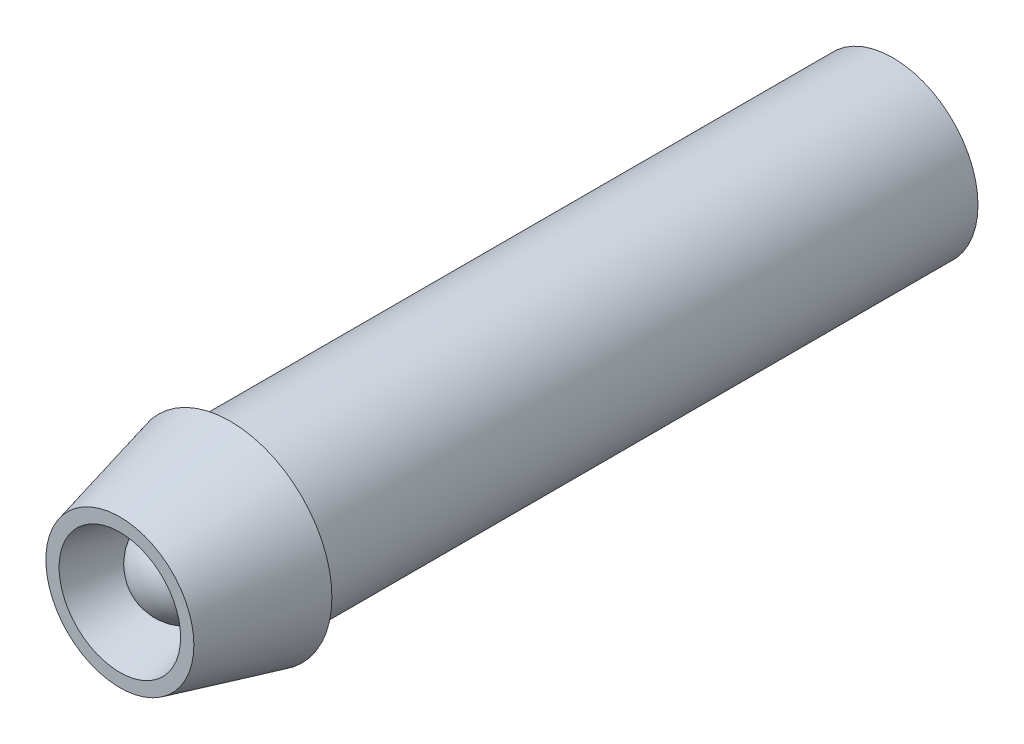
ISO-10303-21;
HEADER;
FILE_DESCRIPTION(('STEP AP214'),'2;1');
FILE_NAME('part.step','',(''),(''),'','','');
FILE_SCHEMA(('AUTOMOTIVE_DESIGN { 1 0 10303 214 1 1 1 1 }'));
ENDSEC;
DATA;
#1=APPLICATION_CONTEXT('core data for automotive mechanical design processes');
#2=APPLICATION_PROTOCOL_DEFINITION('international standard','automotive_design',2000,#1);
#3=PRODUCT_CONTEXT('',#1,'mechanical');
#4=PRODUCT('Part','Part','',(#3));
#5=PRODUCT_RELATED_PRODUCT_CATEGORY('part','',(#4));
#6=PRODUCT_DEFINITION_FORMATION('','',#4);
#7=PRODUCT_DEFINITION_CONTEXT('part definition',#1,'design');
#8=PRODUCT_DEFINITION('design','',#6,#7);
#9=PRODUCT_DEFINITION_SHAPE('','',#8);
#10=(LENGTH_UNIT() NAMED_UNIT(*) SI_UNIT(.MILLI.,.METRE.));
#11=(NAMED_UNIT(*) PLANE_ANGLE_UNIT() SI_UNIT($,.RADIAN.));
#12=(NAMED_UNIT(*) SI_UNIT($,.STERADIAN.) SOLID_ANGLE_UNIT());
#13=UNCERTAINTY_MEASURE_WITH_UNIT(LENGTH_MEASURE(1.E-05),#10,'distance_accuracy_value','');
#14=(GEOMETRIC_REPRESENTATION_CONTEXT(3) GLOBAL_UNCERTAINTY_ASSIGNED_CONTEXT((#13)) GLOBAL_UNIT_ASSIGNED_CONTEXT((#10,
#11,#12)) REPRESENTATION_CONTEXT('',''));
#15=CARTESIAN_POINT('',(0.,0.,0.));
#16=DIRECTION('',(0.,0.,1.));
#17=DIRECTION('',(1.,0.,0.));
#18=AXIS2_PLACEMENT_3D('',#15,#16,#17);
#19=CARTESIAN_POINT('',(0.,0.,1.99999999999994));
#20=DIRECTION('',(0.,0.,1.));
#21=DIRECTION('',(1.,0.,0.));
#22=AXIS2_PLACEMENT_3D('',#19,#20,#21);
#23=PLANE('',#22);
#24=CARTESIAN_POINT('',(0.,0.,1.99999999999994));
#25=DIRECTION('',(0.,0.,1.));
#26=DIRECTION('',(1.,0.,0.));
#27=AXIS2_PLACEMENT_3D('',#24,#25,#26);
#28=CIRCLE('',#27,2.);
#29=CARTESIAN_POINT('',(2.,0.,1.99999999999994));
#30=VERTEX_POINT('',#29);
#31=EDGE_CURVE('E11',#30,#30,#28,.T.);
#32=ORIENTED_EDGE('',*,*,#31,.F.);
#33=EDGE_LOOP('',(#32));
#34=FACE_BOUND('',#33,.T.);
#35=ADVANCED_FACE('F43',(#34),#23,.F.);
#36=CARTESIAN_POINT('',(0.,0.,1.99999999999994));
#37=DIRECTION('',(0.,0.,1.));
#38=DIRECTION('',(1.,0.,0.));
#39=AXIS2_PLACEMENT_3D('',#36,#37,#38);
#40=SPHERICAL_SURFACE('',#39,2.);
#41=ORIENTED_EDGE('',*,*,#31,.T.);
#42=EDGE_LOOP('',(#41));
#43=FACE_BOUND('',#42,.T.);
#44=ADVANCED_FACE('F45',(#43),#40,.T.);
#45=CLOSED_SHELL('',(#35,#44));
#46=MANIFOLD_SOLID_BREP('B2',#45);
#47=CARTESIAN_POINT('',(0.,0.,5.));
#48=DIRECTION('',(0.,0.,1.));
#49=DIRECTION('',(1.,0.,0.));
#50=AXIS2_PLACEMENT_3D('',#47,#48,#49);
#51=PLANE('',#50);
#52=CARTESIAN_POINT('',(0.,0.,5.));
#53=DIRECTION('',(0.,0.,1.));
#54=DIRECTION('',(1.,0.,0.));
#55=AXIS2_PLACEMENT_3D('',#52,#53,#54);
#56=CIRCLE('',#55,2.75);
#57=CARTESIAN_POINT('',(2.75,0.,5.));
#58=VERTEX_POINT('',#57);
#59=EDGE_CURVE('E78',#58,#58,#56,.F.);
#60=ORIENTED_EDGE('',*,*,#59,.T.);
#61=EDGE_LOOP('',(#60));
#62=FACE_BOUND('',#61,.T.);
#63=CARTESIAN_POINT('',(0.,0.,5.));
#64=DIRECTION('',(0.,0.,1.));
#65=DIRECTION('',(1.,0.,0.));
#66=AXIS2_PLACEMENT_3D('',#63,#64,#65);
#67=CIRCLE('',#66,3.35);
#68=CARTESIAN_POINT('',(3.35,0.,5.));
#69=VERTEX_POINT('',#68);
#70=EDGE_CURVE('E91',#69,#69,#67,.T.);
#71=ORIENTED_EDGE('',*,*,#70,.T.);
#72=EDGE_LOOP('',(#71));
#73=FACE_BOUND('',#72,.T.);
#74=ADVANCED_FACE('F71',(#62,#73),#51,.T.);
#75=CARTESIAN_POINT('',(0.,0.,0.));
#76=DIRECTION('',(0.,0.,1.));
#77=DIRECTION('',(1.,0.,0.));
#78=AXIS2_PLACEMENT_3D('',#75,#76,#77);
#79=PLANE('',#78);
#80=CARTESIAN_POINT('',(0.,0.,0.));
#81=DIRECTION('',(0.,0.,1.));
#82=DIRECTION('',(1.,0.,0.));
#83=AXIS2_PLACEMENT_3D('',#80,#81,#82);
#84=CIRCLE('',#83,3.85);
#85=CARTESIAN_POINT('',(3.85,0.,0.));
#86=VERTEX_POINT('',#85);
#87=EDGE_CURVE('E42',#86,#86,#84,.F.);
#88=ORIENTED_EDGE('',*,*,#87,.F.);
#89=EDGE_LOOP('',(#88));
#90=FACE_BOUND('',#89,.T.);
#91=CARTESIAN_POINT('',(0.,0.,0.));
#92=DIRECTION('',(0.,0.,1.));
#93=DIRECTION('',(1.,0.,0.));
#94=AXIS2_PLACEMENT_3D('',#91,#92,#93);
#95=CIRCLE('',#94,4.6);
#96=CARTESIAN_POINT('',(4.6,0.,0.));
#97=VERTEX_POINT('',#96);
#98=EDGE_CURVE('E86',#97,#97,#95,.F.);
#99=ORIENTED_EDGE('',*,*,#98,.T.);
#100=EDGE_LOOP('',(#99));
#101=FACE_BOUND('',#100,.T.);
#102=ADVANCED_FACE('F116',(#90,#101),#79,.F.);
#103=CARTESIAN_POINT('',(0.,0.,5.));
#104=DIRECTION('',(0.,0.,-1.));
#105=DIRECTION('',(-1.,0.,0.));
#106=AXIS2_PLACEMENT_3D('',#103,#104,#105);
#107=CYLINDRICAL_SURFACE('',#106,2.);
#108=CARTESIAN_POINT('',(0.,0.,1.99999999999994));
#109=DIRECTION('',(0.,0.,1.));
#110=DIRECTION('',(1.,0.,0.));
#111=AXIS2_PLACEMENT_3D('',#108,#109,#110);
#112=CIRCLE('',#111,2.);
#113=CARTESIAN_POINT('',(2.,0.,1.99999999999994));
#114=VERTEX_POINT('',#113);
#115=EDGE_CURVE('E82',#114,#114,#112,.T.);
#116=ORIENTED_EDGE('',*,*,#115,.T.);
#117=EDGE_LOOP('',(#116));
#118=FACE_BOUND('',#117,.T.);
#119=CARTESIAN_POINT('',(0.,0.,0.));
#120=DIRECTION('',(0.,0.,1.));
#121=DIRECTION('',(1.,0.,0.));
#122=AXIS2_PLACEMENT_3D('',#119,#120,#121);
#123=CIRCLE('',#122,2.);
#124=CARTESIAN_POINT('',(2.,0.,0.));
#125=VERTEX_POINT('',#124);
#126=EDGE_CURVE('E94',#125,#125,#123,.T.);
#127=ORIENTED_EDGE('',*,*,#126,.F.);
#128=EDGE_LOOP('',(#127));
#129=FACE_BOUND('',#128,.T.);
#130=ADVANCED_FACE('F121',(#118,#129),#107,.F.);
#131=CARTESIAN_POINT('',(0.,0.,5.));
#132=DIRECTION('',(0.,0.,-1.));
#133=DIRECTION('',(-1.,0.,0.));
#134=AXIS2_PLACEMENT_3D('',#131,#132,#133);
#135=CONICAL_SURFACE('',#134,3.35,0.244978663126864);
#136=ORIENTED_EDGE('',*,*,#98,.F.);
#137=EDGE_LOOP('',(#136));
#138=FACE_BOUND('',#137,.T.);
#139=ORIENTED_EDGE('',*,*,#70,.F.);
#140=EDGE_LOOP('',(#139));
#141=FACE_BOUND('',#140,.T.);
#142=ADVANCED_FACE('F125',(#138,#141),#135,.T.);
#143=CARTESIAN_POINT('',(0.,0.,1.99999999999994));
#144=DIRECTION('',(0.,0.,1.));
#145=DIRECTION('',(1.,0.,0.));
#146=AXIS2_PLACEMENT_3D('',#143,#144,#145);
#147=CONICAL_SURFACE('',#146,2.,0.244978663126861);
#148=ORIENTED_EDGE('',*,*,#59,.F.);
#149=EDGE_LOOP('',(#148));
#150=FACE_BOUND('',#149,.T.);
#151=ORIENTED_EDGE('',*,*,#115,.F.);
#152=EDGE_LOOP('',(#151));
#153=FACE_BOUND('',#152,.T.);
#154=ADVANCED_FACE('F73',(#150,#153),#147,.F.);
#155=CARTESIAN_POINT('',(0.,0.,0.));
#156=DIRECTION('',(0.,0.,-1.));
#157=DIRECTION('',(-1.,0.,0.));
#158=AXIS2_PLACEMENT_3D('',#155,#156,#157);
#159=PLANE('',#158);
#160=ORIENTED_EDGE('',*,*,#126,.T.);
#161=EDGE_LOOP('',(#160));
#162=FACE_BOUND('',#161,.T.);
#163=ADVANCED_FACE('F105',(#162),#159,.F.);
#164=CARTESIAN_POINT('',(0.,0.,-30.));
#165=DIRECTION('',(0.,0.,1.));
#166=DIRECTION('',(1.,0.,0.));
#167=AXIS2_PLACEMENT_3D('',#164,#165,#166);
#168=CYLINDRICAL_SURFACE('',#167,3.85);
#169=CARTESIAN_POINT('',(0.,0.,-30.));
#170=DIRECTION('',(0.,0.,-1.));
#171=DIRECTION('',(-1.,0.,0.));
#172=AXIS2_PLACEMENT_3D('',#169,#170,#171);
#173=CIRCLE('',#172,3.85);
#174=CARTESIAN_POINT('',(-3.85,0.,-30.));
#175=VERTEX_POINT('',#174);
#176=EDGE_CURVE('E97',#175,#175,#173,.T.);
#177=ORIENTED_EDGE('',*,*,#176,.F.);
#178=EDGE_LOOP('',(#177));
#179=FACE_BOUND('',#178,.T.);
#180=ORIENTED_EDGE('',*,*,#87,.T.);
#181=EDGE_LOOP('',(#180));
#182=FACE_BOUND('',#181,.T.);
#183=ADVANCED_FACE('F103',(#179,#182),#168,.T.);
#184=CARTESIAN_POINT('',(0.,0.,-30.));
#185=DIRECTION('',(0.,0.,-1.));
#186=DIRECTION('',(-1.,0.,0.));
#187=AXIS2_PLACEMENT_3D('',#184,#185,#186);
#188=PLANE('',#187);
#189=ORIENTED_EDGE('',*,*,#176,.T.);
#190=EDGE_LOOP('',(#189));
#191=FACE_BOUND('',#190,.T.);
#192=ADVANCED_FACE('F101',(#191),#188,.T.);
#193=CLOSED_SHELL('',(#74,#102,#130,#142,#154,#163,#183,#192));
#194=MANIFOLD_SOLID_BREP('B6',#193);
#195=ADVANCED_BREP_SHAPE_REPRESENTATION('',(#18,#46,#194),#14);
#196=SHAPE_DEFINITION_REPRESENTATION(#9,#195);
ENDSEC;
END-ISO-10303-21;
